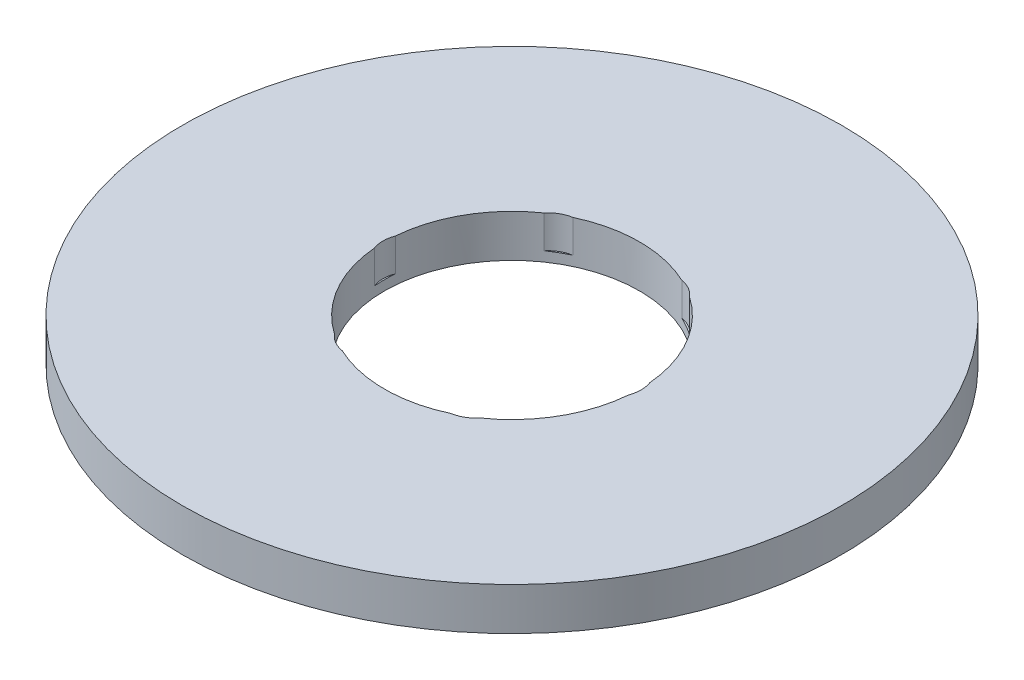
ISO-10303-21;
HEADER;
FILE_DESCRIPTION(('STEP AP214'),'2;1');
FILE_NAME('part.step','',(''),(''),'','','');
FILE_SCHEMA(('AUTOMOTIVE_DESIGN { 1 0 10303 214 1 1 1 1 }'));
ENDSEC;
DATA;
#1=APPLICATION_CONTEXT('core data for automotive mechanical design processes');
#2=APPLICATION_PROTOCOL_DEFINITION('international standard','automotive_design',2000,#1);
#3=PRODUCT_CONTEXT('',#1,'mechanical');
#4=PRODUCT('Part','Part','',(#3));
#5=PRODUCT_RELATED_PRODUCT_CATEGORY('part','',(#4));
#6=PRODUCT_DEFINITION_FORMATION('','',#4);
#7=PRODUCT_DEFINITION_CONTEXT('part definition',#1,'design');
#8=PRODUCT_DEFINITION('design','',#6,#7);
#9=PRODUCT_DEFINITION_SHAPE('','',#8);
#10=(LENGTH_UNIT() NAMED_UNIT(*) SI_UNIT(.MILLI.,.METRE.));
#11=(NAMED_UNIT(*) PLANE_ANGLE_UNIT() SI_UNIT($,.RADIAN.));
#12=(NAMED_UNIT(*) SI_UNIT($,.STERADIAN.) SOLID_ANGLE_UNIT());
#13=UNCERTAINTY_MEASURE_WITH_UNIT(LENGTH_MEASURE(1.E-05),#10,'distance_accuracy_value','');
#14=(GEOMETRIC_REPRESENTATION_CONTEXT(3) GLOBAL_UNCERTAINTY_ASSIGNED_CONTEXT((#13)) GLOBAL_UNIT_ASSIGNED_CONTEXT((#10,
#11,#12)) REPRESENTATION_CONTEXT('',''));
#15=CARTESIAN_POINT('',(0.,0.,0.));
#16=DIRECTION('',(0.,0.,1.));
#17=DIRECTION('',(1.,0.,0.));
#18=AXIS2_PLACEMENT_3D('',#15,#16,#17);
#19=CARTESIAN_POINT('',(0.,10.,0.));
#20=DIRECTION('',(0.,-1.,0.));
#21=DIRECTION('',(0.,0.,-1.));
#22=AXIS2_PLACEMENT_3D('',#19,#20,#21);
#23=CYLINDRICAL_SURFACE('',#22,77.5);
#24=CARTESIAN_POINT('',(0.,10.,0.));
#25=DIRECTION('',(0.,1.,0.));
#26=DIRECTION('',(0.,0.,1.));
#27=AXIS2_PLACEMENT_3D('',#24,#25,#26);
#28=CIRCLE('',#27,77.5);
#29=CARTESIAN_POINT('',(0.,10.,77.5));
#30=VERTEX_POINT('',#29);
#31=EDGE_CURVE('E162',#30,#30,#28,.T.);
#32=ORIENTED_EDGE('',*,*,#31,.F.);
#33=EDGE_LOOP('',(#32));
#34=FACE_BOUND('',#33,.T.);
#35=CARTESIAN_POINT('',(0.,0.,0.));
#36=DIRECTION('',(0.,1.,0.));
#37=DIRECTION('',(0.,0.,1.));
#38=AXIS2_PLACEMENT_3D('',#35,#36,#37);
#39=CIRCLE('',#38,77.5);
#40=CARTESIAN_POINT('',(0.,0.,77.5));
#41=VERTEX_POINT('',#40);
#42=EDGE_CURVE('E157',#41,#41,#39,.T.);
#43=ORIENTED_EDGE('',*,*,#42,.T.);
#44=EDGE_LOOP('',(#43));
#45=FACE_BOUND('',#44,.T.);
#46=ADVANCED_FACE('F39',(#34,#45),#23,.T.);
#47=CARTESIAN_POINT('',(0.,10.,0.));
#48=DIRECTION('',(0.,1.,0.));
#49=DIRECTION('',(0.,0.,1.));
#50=AXIS2_PLACEMENT_3D('',#47,#48,#49);
#51=PLANE('',#50);
#52=CARTESIAN_POINT('',(-11.6501200595189,10.,-20.1785998573635));
#53=DIRECTION('',(0.,1.,0.));
#54=DIRECTION('',(-0.866025403784433,0.,0.50000000000001));
#55=AXIS2_PLACEMENT_3D('',#52,#53,#54);
#56=CIRCLE('',#55,7.05226575211063);
#57=CARTESIAN_POINT('',(-12.7862603212674,10.,-27.1387462311136));
#58=VERTEX_POINT('',#57);
#59=CARTESIAN_POINT('',(-17.1097135023704,10.,-24.6425993731749));
#60=VERTEX_POINT('',#59);
#61=EDGE_CURVE('E218',#58,#60,#56,.T.);
#62=ORIENTED_EDGE('',*,*,#61,.F.);
#63=CARTESIAN_POINT('',(0.,10.,0.));
#64=DIRECTION('',(0.,1.,0.));
#65=DIRECTION('',(0.,0.,1.));
#66=AXIS2_PLACEMENT_3D('',#63,#64,#65);
#67=CIRCLE('',#66,30.);
#68=CARTESIAN_POINT('',(12.7862603212669,10.,-27.1387462311139));
#69=VERTEX_POINT('',#68);
#70=EDGE_CURVE('E169',#69,#58,#67,.T.);
#71=ORIENTED_EDGE('',*,*,#70,.F.);
#72=CARTESIAN_POINT('',(11.6501200595185,10.,-20.1785998573637));
#73=DIRECTION('',(0.,1.,0.));
#74=DIRECTION('',(-0.866025403784443,0.,-0.499999999999992));
#75=AXIS2_PLACEMENT_3D('',#72,#73,#74);
#76=CIRCLE('',#75,7.05226575211063);
#77=CARTESIAN_POINT('',(17.1097135023699,10.,-24.6425993731753));
#78=VERTEX_POINT('',#77);
#79=EDGE_CURVE('E285',#78,#69,#76,.T.);
#80=ORIENTED_EDGE('',*,*,#79,.F.);
#81=CARTESIAN_POINT('',(29.8959738236372,10.,-2.49614685793858));
#82=VERTEX_POINT('',#81);
#83=EDGE_CURVE('E174',#82,#78,#67,.T.);
#84=ORIENTED_EDGE('',*,*,#83,.F.);
#85=CARTESIAN_POINT('',(23.3002401190373,10.,0.));
#86=DIRECTION('',(0.,1.,0.));
#87=DIRECTION('',(0.,0.,-1.));
#88=AXIS2_PLACEMENT_3D('',#85,#86,#87);
#89=CIRCLE('',#88,7.05226575211063);
#90=CARTESIAN_POINT('',(29.8959738236372,10.,2.49614685793858));
#91=VERTEX_POINT('',#90);
#92=EDGE_CURVE('E280',#91,#82,#89,.T.);
#93=ORIENTED_EDGE('',*,*,#92,.F.);
#94=CARTESIAN_POINT('',(17.1097135023703,10.,24.6425993731751));
#95=VERTEX_POINT('',#94);
#96=EDGE_CURVE('E164',#95,#91,#67,.T.);
#97=ORIENTED_EDGE('',*,*,#96,.F.);
#98=CARTESIAN_POINT('',(11.6501200595187,10.,20.1785998573636));
#99=DIRECTION('',(0.,1.,0.));
#100=DIRECTION('',(0.866025403784436,0.,-0.500000000000004));
#101=AXIS2_PLACEMENT_3D('',#98,#99,#100);
#102=CIRCLE('',#101,7.05226575211063);
#103=CARTESIAN_POINT('',(12.7862603212672,10.,27.1387462311137));
#104=VERTEX_POINT('',#103);
#105=EDGE_CURVE('E269',#104,#95,#102,.T.);
#106=ORIENTED_EDGE('',*,*,#105,.F.);
#107=CARTESIAN_POINT('',(-12.786260321267,10.,27.1387462311138));
#108=VERTEX_POINT('',#107);
#109=EDGE_CURVE('E149',#108,#104,#67,.T.);
#110=ORIENTED_EDGE('',*,*,#109,.F.);
#111=CARTESIAN_POINT('',(-11.6501200595186,10.,20.1785998573637));
#112=DIRECTION('',(0.,1.,0.));
#113=DIRECTION('',(0.86602540378444,0.,0.499999999999998));
#114=AXIS2_PLACEMENT_3D('',#111,#112,#113);
#115=CIRCLE('',#114,7.05226575211063);
#116=CARTESIAN_POINT('',(-17.1097135023701,10.,24.6425993731752));
#117=VERTEX_POINT('',#116);
#118=EDGE_CURVE('E128',#117,#108,#115,.T.);
#119=ORIENTED_EDGE('',*,*,#118,.F.);
#120=CARTESIAN_POINT('',(-29.8959738236372,10.,2.49614685793858));
#121=VERTEX_POINT('',#120);
#122=EDGE_CURVE('E148',#121,#117,#67,.T.);
#123=ORIENTED_EDGE('',*,*,#122,.F.);
#124=CARTESIAN_POINT('',(-23.3002401190373,10.,0.));
#125=DIRECTION('',(0.,1.,0.));
#126=DIRECTION('',(0.,0.,1.));
#127=AXIS2_PLACEMENT_3D('',#124,#125,#126);
#128=CIRCLE('',#127,7.05226575211063);
#129=CARTESIAN_POINT('',(-29.8959738236372,10.,-2.49614685793858));
#130=VERTEX_POINT('',#129);
#131=EDGE_CURVE('E179',#130,#121,#128,.T.);
#132=ORIENTED_EDGE('',*,*,#131,.F.);
#133=EDGE_CURVE('E161',#60,#130,#67,.T.);
#134=ORIENTED_EDGE('',*,*,#133,.F.);
#135=EDGE_LOOP('',(#62,#71,#80,#84,#93,#97,#106,#110,#119,#123,#132,#134));
#136=FACE_BOUND('',#135,.T.);
#137=ORIENTED_EDGE('',*,*,#31,.T.);
#138=EDGE_LOOP('',(#137));
#139=FACE_BOUND('',#138,.T.);
#140=ADVANCED_FACE('F141',(#136,#139),#51,.T.);
#141=CARTESIAN_POINT('',(0.,0.,0.));
#142=DIRECTION('',(0.,1.,0.));
#143=DIRECTION('',(0.,0.,1.));
#144=AXIS2_PLACEMENT_3D('',#141,#142,#143);
#145=PLANE('',#144);
#146=CARTESIAN_POINT('',(0.,0.,0.));
#147=DIRECTION('',(0.,1.,0.));
#148=DIRECTION('',(0.,0.,1.));
#149=AXIS2_PLACEMENT_3D('',#146,#147,#148);
#150=CIRCLE('',#149,30.);
#151=CARTESIAN_POINT('',(0.,0.,30.));
#152=VERTEX_POINT('',#151);
#153=EDGE_CURVE('E166',#152,#152,#150,.T.);
#154=ORIENTED_EDGE('',*,*,#153,.T.);
#155=EDGE_LOOP('',(#154));
#156=FACE_BOUND('',#155,.T.);
#157=ORIENTED_EDGE('',*,*,#42,.F.);
#158=EDGE_LOOP('',(#157));
#159=FACE_BOUND('',#158,.T.);
#160=ADVANCED_FACE('F234',(#156,#159),#145,.F.);
#161=CARTESIAN_POINT('',(0.,10.,0.));
#162=DIRECTION('',(0.,-1.,0.));
#163=DIRECTION('',(0.,0.,-1.));
#164=AXIS2_PLACEMENT_3D('',#161,#162,#163);
#165=CYLINDRICAL_SURFACE('',#164,30.);
#166=DIRECTION('',(0.,1.,0.));
#167=VECTOR('',#166,1.);
#168=CARTESIAN_POINT('',(-12.7862603212674,6.14722955112903,-27.1387462311136));
#169=LINE('',#168,#167);
#170=CARTESIAN_POINT('',(-12.7862603212674,2.29445910225806,-27.1387462311136));
#171=VERTEX_POINT('',#170);
#172=EDGE_CURVE('E11',#171,#58,#169,.T.);
#173=ORIENTED_EDGE('',*,*,#172,.F.);
#174=CARTESIAN_POINT('',(0.,2.29445910225806,0.));
#175=DIRECTION('',(0.,1.,0.));
#176=DIRECTION('',(0.,0.,1.));
#177=AXIS2_PLACEMENT_3D('',#174,#175,#176);
#178=CIRCLE('',#177,30.);
#179=CARTESIAN_POINT('',(-17.1097135023704,2.29445910225806,-24.6425993731749));
#180=VERTEX_POINT('',#179);
#181=EDGE_CURVE('E214',#171,#180,#178,.T.);
#182=ORIENTED_EDGE('',*,*,#181,.T.);
#183=DIRECTION('',(0.,1.,0.));
#184=VECTOR('',#183,1.);
#185=CARTESIAN_POINT('',(-17.1097135023705,6.14722955112903,-24.6425993731749));
#186=LINE('',#185,#184);
#187=EDGE_CURVE('E46',#60,#180,#186,.F.);
#188=ORIENTED_EDGE('',*,*,#187,.F.);
#189=ORIENTED_EDGE('',*,*,#133,.T.);
#190=DIRECTION('',(0.,1.,0.));
#191=VECTOR('',#190,1.);
#192=CARTESIAN_POINT('',(-29.8959738236372,6.14722955112903,-2.49614685793862));
#193=LINE('',#192,#191);
#194=CARTESIAN_POINT('',(-29.8959738236372,2.29445910225806,-2.49614685793858));
#195=VERTEX_POINT('',#194);
#196=EDGE_CURVE('E187',#195,#130,#193,.T.);
#197=ORIENTED_EDGE('',*,*,#196,.F.);
#198=CARTESIAN_POINT('',(0.,2.29445910225806,0.));
#199=DIRECTION('',(0.,1.,0.));
#200=DIRECTION('',(0.,0.,1.));
#201=AXIS2_PLACEMENT_3D('',#198,#199,#200);
#202=CIRCLE('',#201,30.);
#203=CARTESIAN_POINT('',(-29.8959738236372,2.29445910225806,2.49614685793858));
#204=VERTEX_POINT('',#203);
#205=EDGE_CURVE('E184',#195,#204,#202,.T.);
#206=ORIENTED_EDGE('',*,*,#205,.T.);
#207=DIRECTION('',(0.,1.,0.));
#208=VECTOR('',#207,1.);
#209=CARTESIAN_POINT('',(-29.8959738236372,6.14722955112903,2.49614685793862));
#210=LINE('',#209,#208);
#211=EDGE_CURVE('E158',#121,#204,#210,.F.);
#212=ORIENTED_EDGE('',*,*,#211,.F.);
#213=ORIENTED_EDGE('',*,*,#122,.T.);
#214=DIRECTION('',(0.,1.,0.));
#215=VECTOR('',#214,1.);
#216=CARTESIAN_POINT('',(-17.1097135023701,6.14722955112903,24.6425993731752));
#217=LINE('',#216,#215);
#218=CARTESIAN_POINT('',(-17.1097135023701,2.29445910225806,24.6425993731752));
#219=VERTEX_POINT('',#218);
#220=EDGE_CURVE('E127',#219,#117,#217,.T.);
#221=ORIENTED_EDGE('',*,*,#220,.F.);
#222=CARTESIAN_POINT('',(0.,2.29445910225806,0.));
#223=DIRECTION('',(0.,1.,0.));
#224=DIRECTION('',(0.,0.,1.));
#225=AXIS2_PLACEMENT_3D('',#222,#223,#224);
#226=CIRCLE('',#225,30.);
#227=CARTESIAN_POINT('',(-12.786260321267,2.29445910225806,27.1387462311138));
#228=VERTEX_POINT('',#227);
#229=EDGE_CURVE('E189',#219,#228,#226,.T.);
#230=ORIENTED_EDGE('',*,*,#229,.T.);
#231=DIRECTION('',(0.,1.,0.));
#232=VECTOR('',#231,1.);
#233=CARTESIAN_POINT('',(-12.786260321267,6.14722955112903,27.1387462311138));
#234=LINE('',#233,#232);
#235=EDGE_CURVE('E140',#108,#228,#234,.F.);
#236=ORIENTED_EDGE('',*,*,#235,.F.);
#237=ORIENTED_EDGE('',*,*,#109,.T.);
#238=DIRECTION('',(0.,1.,0.));
#239=VECTOR('',#238,1.);
#240=CARTESIAN_POINT('',(12.7862603212672,6.14722955112903,27.1387462311137));
#241=LINE('',#240,#239);
#242=CARTESIAN_POINT('',(12.7862603212672,2.29445910225806,27.1387462311137));
#243=VERTEX_POINT('',#242);
#244=EDGE_CURVE('E196',#243,#104,#241,.T.);
#245=ORIENTED_EDGE('',*,*,#244,.F.);
#246=CARTESIAN_POINT('',(0.,2.29445910225806,0.));
#247=DIRECTION('',(0.,1.,0.));
#248=DIRECTION('',(0.,0.,1.));
#249=AXIS2_PLACEMENT_3D('',#246,#247,#248);
#250=CIRCLE('',#249,30.);
#251=CARTESIAN_POINT('',(17.1097135023703,2.29445910225806,24.6425993731751));
#252=VERTEX_POINT('',#251);
#253=EDGE_CURVE('E136',#243,#252,#250,.T.);
#254=ORIENTED_EDGE('',*,*,#253,.T.);
#255=DIRECTION('',(0.,1.,0.));
#256=VECTOR('',#255,1.);
#257=CARTESIAN_POINT('',(17.1097135023703,6.14722955112903,24.642599373175));
#258=LINE('',#257,#256);
#259=EDGE_CURVE('E194',#95,#252,#258,.F.);
#260=ORIENTED_EDGE('',*,*,#259,.F.);
#261=ORIENTED_EDGE('',*,*,#96,.T.);
#262=DIRECTION('',(0.,1.,0.));
#263=VECTOR('',#262,1.);
#264=CARTESIAN_POINT('',(29.8959738236372,6.14722955112903,2.49614685793862));
#265=LINE('',#264,#263);
#266=CARTESIAN_POINT('',(29.8959738236372,2.29445910225806,2.49614685793858));
#267=VERTEX_POINT('',#266);
#268=EDGE_CURVE('E206',#267,#91,#265,.T.);
#269=ORIENTED_EDGE('',*,*,#268,.F.);
#270=CARTESIAN_POINT('',(0.,2.29445910225806,0.));
#271=DIRECTION('',(0.,1.,0.));
#272=DIRECTION('',(0.,0.,1.));
#273=AXIS2_PLACEMENT_3D('',#270,#271,#272);
#274=CIRCLE('',#273,30.);
#275=CARTESIAN_POINT('',(29.8959738236372,2.29445910225806,-2.49614685793858));
#276=VERTEX_POINT('',#275);
#277=EDGE_CURVE('E199',#267,#276,#274,.T.);
#278=ORIENTED_EDGE('',*,*,#277,.T.);
#279=DIRECTION('',(0.,1.,0.));
#280=VECTOR('',#279,1.);
#281=CARTESIAN_POINT('',(29.8959738236372,6.14722955112903,-2.49614685793862));
#282=LINE('',#281,#280);
#283=EDGE_CURVE('E201',#82,#276,#282,.F.);
#284=ORIENTED_EDGE('',*,*,#283,.F.);
#285=ORIENTED_EDGE('',*,*,#83,.T.);
#286=DIRECTION('',(0.,1.,0.));
#287=VECTOR('',#286,1.);
#288=CARTESIAN_POINT('',(17.1097135023699,6.14722955112903,-24.6425993731753));
#289=LINE('',#288,#287);
#290=CARTESIAN_POINT('',(17.1097135023699,2.29445910225806,-24.6425993731753));
#291=VERTEX_POINT('',#290);
#292=EDGE_CURVE('E213',#291,#78,#289,.T.);
#293=ORIENTED_EDGE('',*,*,#292,.F.);
#294=CARTESIAN_POINT('',(0.,2.29445910225806,0.));
#295=DIRECTION('',(0.,1.,0.));
#296=DIRECTION('',(0.,0.,1.));
#297=AXIS2_PLACEMENT_3D('',#294,#295,#296);
#298=CIRCLE('',#297,30.);
#299=CARTESIAN_POINT('',(12.7862603212669,2.29445910225806,-27.1387462311139));
#300=VERTEX_POINT('',#299);
#301=EDGE_CURVE('E208',#291,#300,#298,.T.);
#302=ORIENTED_EDGE('',*,*,#301,.T.);
#303=DIRECTION('',(0.,1.,0.));
#304=VECTOR('',#303,1.);
#305=CARTESIAN_POINT('',(12.7862603212668,6.14722955112903,-27.1387462311139));
#306=LINE('',#305,#304);
#307=EDGE_CURVE('E211',#69,#300,#306,.F.);
#308=ORIENTED_EDGE('',*,*,#307,.F.);
#309=ORIENTED_EDGE('',*,*,#70,.T.);
#310=EDGE_LOOP('',(#173,#182,#188,#189,#197,#206,#212,#213,#221,#230,#236,#237,#245,#254,#260,
#261,#269,#278,#284,#285,#293,#302,#308,#309));
#311=FACE_BOUND('',#310,.T.);
#312=ORIENTED_EDGE('',*,*,#153,.F.);
#313=EDGE_LOOP('',(#312));
#314=FACE_BOUND('',#313,.T.);
#315=ADVANCED_FACE('F152',(#311,#314),#165,.F.);
#316=CARTESIAN_POINT('',(-23.3002401190373,2.29445910225806,0.));
#317=DIRECTION('',(0.,1.,0.));
#318=DIRECTION('',(0.,0.,1.));
#319=AXIS2_PLACEMENT_3D('',#316,#317,#318);
#320=CYLINDRICAL_SURFACE('',#319,7.05226575211063);
#321=ORIENTED_EDGE('',*,*,#196,.T.);
#322=ORIENTED_EDGE('',*,*,#131,.T.);
#323=ORIENTED_EDGE('',*,*,#211,.T.);
#324=CARTESIAN_POINT('',(-23.3002401190373,2.29445910225806,0.));
#325=DIRECTION('',(0.,1.,0.));
#326=DIRECTION('',(0.,0.,1.));
#327=AXIS2_PLACEMENT_3D('',#324,#325,#326);
#328=CIRCLE('',#327,7.05226575211063);
#329=EDGE_CURVE('E180',#195,#204,#328,.T.);
#330=ORIENTED_EDGE('',*,*,#329,.F.);
#331=EDGE_LOOP('',(#321,#322,#323,#330));
#332=FACE_BOUND('',#331,.T.);
#333=ADVANCED_FACE('F244',(#332),#320,.F.);
#334=CARTESIAN_POINT('',(-23.3002401190373,2.29445910225806,0.));
#335=DIRECTION('',(0.,1.,0.));
#336=DIRECTION('',(0.,0.,1.));
#337=AXIS2_PLACEMENT_3D('',#334,#335,#336);
#338=PLANE('',#337);
#339=ORIENTED_EDGE('',*,*,#329,.T.);
#340=ORIENTED_EDGE('',*,*,#205,.F.);
#341=EDGE_LOOP('',(#339,#340));
#342=FACE_BOUND('',#341,.T.);
#343=ADVANCED_FACE('F248',(#342),#338,.T.);
#344=CARTESIAN_POINT('',(-11.6501200595186,2.29445910225806,20.1785998573637));
#345=DIRECTION('',(0.,1.,0.));
#346=DIRECTION('',(0.,0.,1.));
#347=AXIS2_PLACEMENT_3D('',#344,#345,#346);
#348=CYLINDRICAL_SURFACE('',#347,7.05226575211063);
#349=ORIENTED_EDGE('',*,*,#220,.T.);
#350=ORIENTED_EDGE('',*,*,#118,.T.);
#351=ORIENTED_EDGE('',*,*,#235,.T.);
#352=CARTESIAN_POINT('',(-11.6501200595186,2.29445910225806,20.1785998573637));
#353=DIRECTION('',(0.,1.,0.));
#354=DIRECTION('',(0.86602540378444,0.,0.499999999999998));
#355=AXIS2_PLACEMENT_3D('',#352,#353,#354);
#356=CIRCLE('',#355,7.05226575211063);
#357=EDGE_CURVE('E135',#219,#228,#356,.T.);
#358=ORIENTED_EDGE('',*,*,#357,.F.);
#359=EDGE_LOOP('',(#349,#350,#351,#358));
#360=FACE_BOUND('',#359,.T.);
#361=ADVANCED_FACE('F126',(#360),#348,.F.);
#362=CARTESIAN_POINT('',(-11.6501200595186,2.29445910225806,20.1785998573637));
#363=DIRECTION('',(0.,1.,0.));
#364=DIRECTION('',(0.86602540378444,0.,0.499999999999998));
#365=AXIS2_PLACEMENT_3D('',#362,#363,#364);
#366=PLANE('',#365);
#367=ORIENTED_EDGE('',*,*,#357,.T.);
#368=ORIENTED_EDGE('',*,*,#229,.F.);
#369=EDGE_LOOP('',(#367,#368));
#370=FACE_BOUND('',#369,.T.);
#371=ADVANCED_FACE('F258',(#370),#366,.T.);
#372=CARTESIAN_POINT('',(11.6501200595187,2.29445910225806,20.1785998573636));
#373=DIRECTION('',(0.,1.,0.));
#374=DIRECTION('',(0.,0.,1.));
#375=AXIS2_PLACEMENT_3D('',#372,#373,#374);
#376=CYLINDRICAL_SURFACE('',#375,7.05226575211063);
#377=ORIENTED_EDGE('',*,*,#244,.T.);
#378=ORIENTED_EDGE('',*,*,#105,.T.);
#379=ORIENTED_EDGE('',*,*,#259,.T.);
#380=CARTESIAN_POINT('',(11.6501200595187,2.29445910225806,20.1785998573636));
#381=DIRECTION('',(0.,1.,0.));
#382=DIRECTION('',(0.866025403784436,0.,-0.500000000000004));
#383=AXIS2_PLACEMENT_3D('',#380,#381,#382);
#384=CIRCLE('',#383,7.05226575211063);
#385=EDGE_CURVE('E147',#243,#252,#384,.T.);
#386=ORIENTED_EDGE('',*,*,#385,.F.);
#387=EDGE_LOOP('',(#377,#378,#379,#386));
#388=FACE_BOUND('',#387,.T.);
#389=ADVANCED_FACE('F256',(#388),#376,.F.);
#390=CARTESIAN_POINT('',(11.6501200595187,2.29445910225806,20.1785998573636));
#391=DIRECTION('',(0.,1.,0.));
#392=DIRECTION('',(0.866025403784436,0.,-0.500000000000004));
#393=AXIS2_PLACEMENT_3D('',#390,#391,#392);
#394=PLANE('',#393);
#395=ORIENTED_EDGE('',*,*,#385,.T.);
#396=ORIENTED_EDGE('',*,*,#253,.F.);
#397=EDGE_LOOP('',(#395,#396));
#398=FACE_BOUND('',#397,.T.);
#399=ADVANCED_FACE('F263',(#398),#394,.T.);
#400=CARTESIAN_POINT('',(23.3002401190373,2.29445910225806,0.));
#401=DIRECTION('',(0.,1.,0.));
#402=DIRECTION('',(0.,0.,1.));
#403=AXIS2_PLACEMENT_3D('',#400,#401,#402);
#404=CYLINDRICAL_SURFACE('',#403,7.05226575211063);
#405=ORIENTED_EDGE('',*,*,#268,.T.);
#406=ORIENTED_EDGE('',*,*,#92,.T.);
#407=ORIENTED_EDGE('',*,*,#283,.T.);
#408=CARTESIAN_POINT('',(23.3002401190373,2.29445910225806,0.));
#409=DIRECTION('',(0.,1.,0.));
#410=DIRECTION('',(0.,0.,-1.));
#411=AXIS2_PLACEMENT_3D('',#408,#409,#410);
#412=CIRCLE('',#411,7.05226575211063);
#413=EDGE_CURVE('E273',#267,#276,#412,.T.);
#414=ORIENTED_EDGE('',*,*,#413,.F.);
#415=EDGE_LOOP('',(#405,#406,#407,#414));
#416=FACE_BOUND('',#415,.T.);
#417=ADVANCED_FACE('F297',(#416),#404,.F.);
#418=CARTESIAN_POINT('',(23.3002401190373,2.29445910225806,0.));
#419=DIRECTION('',(0.,1.,0.));
#420=DIRECTION('',(0.,0.,-1.));
#421=AXIS2_PLACEMENT_3D('',#418,#419,#420);
#422=PLANE('',#421);
#423=ORIENTED_EDGE('',*,*,#413,.T.);
#424=ORIENTED_EDGE('',*,*,#277,.F.);
#425=EDGE_LOOP('',(#423,#424));
#426=FACE_BOUND('',#425,.T.);
#427=ADVANCED_FACE('F299',(#426),#422,.T.);
#428=CARTESIAN_POINT('',(11.6501200595185,2.29445910225806,-20.1785998573637));
#429=DIRECTION('',(0.,1.,0.));
#430=DIRECTION('',(0.,0.,1.));
#431=AXIS2_PLACEMENT_3D('',#428,#429,#430);
#432=CYLINDRICAL_SURFACE('',#431,7.05226575211063);
#433=ORIENTED_EDGE('',*,*,#292,.T.);
#434=ORIENTED_EDGE('',*,*,#79,.T.);
#435=ORIENTED_EDGE('',*,*,#307,.T.);
#436=CARTESIAN_POINT('',(11.6501200595185,2.29445910225806,-20.1785998573637));
#437=DIRECTION('',(0.,1.,0.));
#438=DIRECTION('',(-0.866025403784443,0.,-0.499999999999992));
#439=AXIS2_PLACEMENT_3D('',#436,#437,#438);
#440=CIRCLE('',#439,7.05226575211063);
#441=EDGE_CURVE('E56',#291,#300,#440,.T.);
#442=ORIENTED_EDGE('',*,*,#441,.F.);
#443=EDGE_LOOP('',(#433,#434,#435,#442));
#444=FACE_BOUND('',#443,.T.);
#445=ADVANCED_FACE('F292',(#444),#432,.F.);
#446=CARTESIAN_POINT('',(11.6501200595185,2.29445910225806,-20.1785998573637));
#447=DIRECTION('',(0.,1.,0.));
#448=DIRECTION('',(-0.866025403784443,0.,-0.499999999999992));
#449=AXIS2_PLACEMENT_3D('',#446,#447,#448);
#450=PLANE('',#449);
#451=ORIENTED_EDGE('',*,*,#441,.T.);
#452=ORIENTED_EDGE('',*,*,#301,.F.);
#453=EDGE_LOOP('',(#451,#452));
#454=FACE_BOUND('',#453,.T.);
#455=ADVANCED_FACE('F226',(#454),#450,.T.);
#456=CARTESIAN_POINT('',(-11.6501200595189,2.29445910225806,-20.1785998573635));
#457=DIRECTION('',(0.,1.,0.));
#458=DIRECTION('',(0.,0.,1.));
#459=AXIS2_PLACEMENT_3D('',#456,#457,#458);
#460=CYLINDRICAL_SURFACE('',#459,7.05226575211063);
#461=ORIENTED_EDGE('',*,*,#172,.T.);
#462=ORIENTED_EDGE('',*,*,#61,.T.);
#463=ORIENTED_EDGE('',*,*,#187,.T.);
#464=CARTESIAN_POINT('',(-11.6501200595189,2.29445910225806,-20.1785998573635));
#465=DIRECTION('',(0.,1.,0.));
#466=DIRECTION('',(-0.866025403784433,0.,0.50000000000001));
#467=AXIS2_PLACEMENT_3D('',#464,#465,#466);
#468=CIRCLE('',#467,7.05226575211063);
#469=EDGE_CURVE('E55',#171,#180,#468,.T.);
#470=ORIENTED_EDGE('',*,*,#469,.F.);
#471=EDGE_LOOP('',(#461,#462,#463,#470));
#472=FACE_BOUND('',#471,.T.);
#473=ADVANCED_FACE('F217',(#472),#460,.F.);
#474=CARTESIAN_POINT('',(-11.6501200595189,2.29445910225806,-20.1785998573635));
#475=DIRECTION('',(0.,1.,0.));
#476=DIRECTION('',(-0.866025403784433,0.,0.50000000000001));
#477=AXIS2_PLACEMENT_3D('',#474,#475,#476);
#478=PLANE('',#477);
#479=ORIENTED_EDGE('',*,*,#469,.T.);
#480=ORIENTED_EDGE('',*,*,#181,.F.);
#481=EDGE_LOOP('',(#479,#480));
#482=FACE_BOUND('',#481,.T.);
#483=ADVANCED_FACE('F219',(#482),#478,.T.);
#484=CLOSED_SHELL('',(#46,#140,#160,#315,#333,#343,#361,#371,#389,#399,#417,#427,#445,#455,#473,#483));
#485=MANIFOLD_SOLID_BREP('B2',#484);
#486=ADVANCED_BREP_SHAPE_REPRESENTATION('',(#18,#485),#14);
#487=SHAPE_DEFINITION_REPRESENTATION(#9,#486);
ENDSEC;
END-ISO-10303-21;
